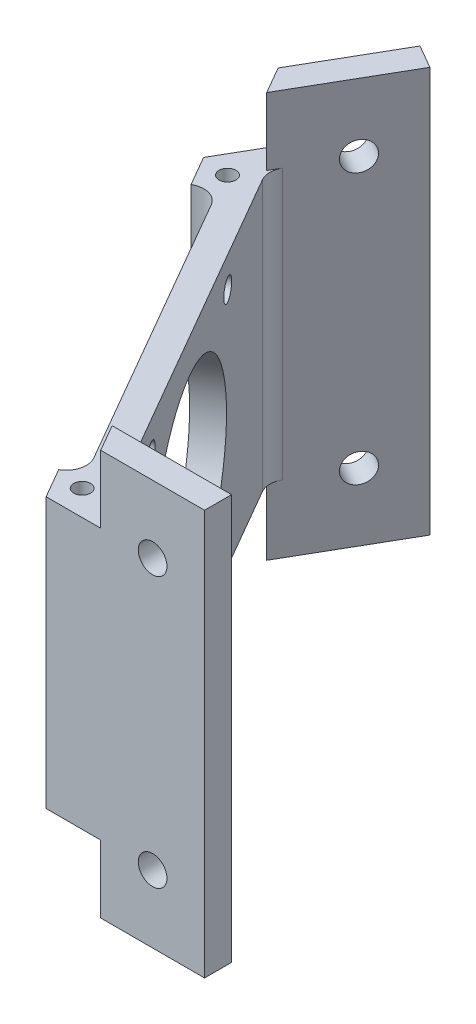
ISO-10303-21;
HEADER;
FILE_DESCRIPTION(('STEP AP214'),'2;1');
FILE_NAME('part.step','',(''),(''),'','','');
FILE_SCHEMA(('AUTOMOTIVE_DESIGN { 1 0 10303 214 1 1 1 1 }'));
ENDSEC;
DATA;
#1=APPLICATION_CONTEXT('core data for automotive mechanical design processes');
#2=APPLICATION_PROTOCOL_DEFINITION('international standard','automotive_design',2000,#1);
#3=PRODUCT_CONTEXT('',#1,'mechanical');
#4=PRODUCT('Part','Part','',(#3));
#5=PRODUCT_RELATED_PRODUCT_CATEGORY('part','',(#4));
#6=PRODUCT_DEFINITION_FORMATION('','',#4);
#7=PRODUCT_DEFINITION_CONTEXT('part definition',#1,'design');
#8=PRODUCT_DEFINITION('design','',#6,#7);
#9=PRODUCT_DEFINITION_SHAPE('','',#8);
#10=(LENGTH_UNIT() NAMED_UNIT(*) SI_UNIT(.MILLI.,.METRE.));
#11=(NAMED_UNIT(*) PLANE_ANGLE_UNIT() SI_UNIT($,.RADIAN.));
#12=(NAMED_UNIT(*) SI_UNIT($,.STERADIAN.) SOLID_ANGLE_UNIT());
#13=UNCERTAINTY_MEASURE_WITH_UNIT(LENGTH_MEASURE(1.E-05),#10,'distance_accuracy_value','');
#14=(GEOMETRIC_REPRESENTATION_CONTEXT(3) GLOBAL_UNCERTAINTY_ASSIGNED_CONTEXT((#13)) GLOBAL_UNIT_ASSIGNED_CONTEXT((#10,
#11,#12)) REPRESENTATION_CONTEXT('',''));
#15=CARTESIAN_POINT('',(0.,0.,0.));
#16=DIRECTION('',(0.,0.,1.));
#17=DIRECTION('',(1.,0.,0.));
#18=AXIS2_PLACEMENT_3D('',#15,#16,#17);
#19=CARTESIAN_POINT('',(84.4999999999999,60.,-9.99999999999996));
#20=DIRECTION('',(0.,0.,-1.));
#21=DIRECTION('',(-1.,0.,0.));
#22=AXIS2_PLACEMENT_3D('',#19,#20,#21);
#23=PLANE('',#22);
#24=CARTESIAN_POINT('',(96.8094010767584,50.,-9.99999999999961));
#25=DIRECTION('',(0.,0.,1.));
#26=DIRECTION('',(1.,0.,0.));
#27=AXIS2_PLACEMENT_3D('',#24,#25,#26);
#28=CIRCLE('',#27,2.125);
#29=CARTESIAN_POINT('',(98.9344010767584,50.,-9.99999999999961));
#30=VERTEX_POINT('',#29);
#31=EDGE_CURVE('E397',#30,#30,#28,.T.);
#32=ORIENTED_EDGE('',*,*,#31,.F.);
#33=EDGE_LOOP('',(#32));
#34=FACE_BOUND('',#33,.T.);
#35=CARTESIAN_POINT('',(96.8094010767584,10.,-9.99999999999961));
#36=DIRECTION('',(0.,0.,1.));
#37=DIRECTION('',(1.,0.,0.));
#38=AXIS2_PLACEMENT_3D('',#35,#36,#37);
#39=CIRCLE('',#38,2.125);
#40=CARTESIAN_POINT('',(98.9344010767584,10.,-9.99999999999961));
#41=VERTEX_POINT('',#40);
#42=EDGE_CURVE('E392',#41,#41,#39,.T.);
#43=ORIENTED_EDGE('',*,*,#42,.F.);
#44=EDGE_LOOP('',(#43));
#45=FACE_BOUND('',#44,.T.);
#46=DIRECTION('',(1.,0.,0.));
#47=VECTOR('',#46,1.);
#48=CARTESIAN_POINT('',(89.118802153517,50.,-9.99999999999996));
#49=LINE('',#48,#47);
#50=CARTESIAN_POINT('',(81.0358,50.,-10.));
#51=VERTEX_POINT('',#50);
#52=CARTESIAN_POINT('',(89.118802153517,50.,-9.99999999999996));
#53=VERTEX_POINT('',#52);
#54=EDGE_CURVE('E192',#51,#53,#49,.T.);
#55=ORIENTED_EDGE('',*,*,#54,.F.);
#56=DIRECTION('',(0.,1.,0.));
#57=VECTOR('',#56,1.);
#58=CARTESIAN_POINT('',(81.0358,-54.9007891464202,-10.));
#59=LINE('',#58,#57);
#60=CARTESIAN_POINT('',(81.0358,10.,-10.));
#61=VERTEX_POINT('',#60);
#62=EDGE_CURVE('E178',#61,#51,#59,.T.);
#63=ORIENTED_EDGE('',*,*,#62,.F.);
#64=DIRECTION('',(1.,0.,0.));
#65=VECTOR('',#64,1.);
#66=CARTESIAN_POINT('',(89.118802153517,10.,-9.99999999999996));
#67=LINE('',#66,#65);
#68=CARTESIAN_POINT('',(89.118802153517,10.,-9.99999999999996));
#69=VERTEX_POINT('',#68);
#70=EDGE_CURVE('E425',#61,#69,#67,.T.);
#71=ORIENTED_EDGE('',*,*,#70,.T.);
#72=DIRECTION('',(0.,-1.,0.));
#73=VECTOR('',#72,1.);
#74=CARTESIAN_POINT('',(89.118802153517,10.,-9.99999999999996));
#75=LINE('',#74,#73);
#76=CARTESIAN_POINT('',(89.118802153517,0.,-9.99999999999996));
#77=VERTEX_POINT('',#76);
#78=EDGE_CURVE('E325',#69,#77,#75,.T.);
#79=ORIENTED_EDGE('',*,*,#78,.T.);
#80=DIRECTION('',(1.,0.,0.));
#81=VECTOR('',#80,1.);
#82=CARTESIAN_POINT('',(84.4999999999999,0.,-9.99999999999996));
#83=LINE('',#82,#81);
#84=CARTESIAN_POINT('',(104.5,0.,-10.));
#85=VERTEX_POINT('',#84);
#86=EDGE_CURVE('E235',#77,#85,#83,.T.);
#87=ORIENTED_EDGE('',*,*,#86,.T.);
#88=DIRECTION('',(0.,-1.,0.));
#89=VECTOR('',#88,1.);
#90=CARTESIAN_POINT('',(104.5,60.,-10.));
#91=LINE('',#90,#89);
#92=CARTESIAN_POINT('',(104.5,60.,-10.));
#93=VERTEX_POINT('',#92);
#94=EDGE_CURVE('E283',#93,#85,#91,.T.);
#95=ORIENTED_EDGE('',*,*,#94,.F.);
#96=DIRECTION('',(1.,0.,0.));
#97=VECTOR('',#96,1.);
#98=CARTESIAN_POINT('',(76.4171,60.,-10.));
#99=LINE('',#98,#97);
#100=CARTESIAN_POINT('',(89.118802153517,60.,-9.99999999999996));
#101=VERTEX_POINT('',#100);
#102=EDGE_CURVE('E239',#101,#93,#99,.T.);
#103=ORIENTED_EDGE('',*,*,#102,.F.);
#104=DIRECTION('',(0.,1.,0.));
#105=VECTOR('',#104,1.);
#106=CARTESIAN_POINT('',(89.118802153517,50.,-9.99999999999996));
#107=LINE('',#106,#105);
#108=EDGE_CURVE('E200',#53,#101,#107,.T.);
#109=ORIENTED_EDGE('',*,*,#108,.F.);
#110=EDGE_LOOP('',(#55,#63,#71,#79,#87,#95,#103,#109));
#111=FACE_BOUND('',#110,.T.);
#112=ADVANCED_FACE('F32',(#34,#45,#111),#23,.F.);
#113=CARTESIAN_POINT('',(60.9102540378444,60.,-85.4996546954738));
#114=DIRECTION('',(0.866025403784438,0.,0.500000000000001));
#115=DIRECTION('',(0.500000000000001,0.,-0.866025403784438));
#116=AXIS2_PLACEMENT_3D('',#113,#114,#115);
#117=PLANE('',#116);
#118=CARTESIAN_POINT('',(57.0649545762236,50.,-78.8394006576293));
#119=DIRECTION('',(-0.866025403784438,0.,-0.500000000000001));
#120=DIRECTION('',(-0.500000000000001,0.,0.866025403784438));
#121=AXIS2_PLACEMENT_3D('',#118,#119,#120);
#122=CIRCLE('',#121,2.12500000000001);
#123=CARTESIAN_POINT('',(56.0024545762236,50.,-76.9990966745874));
#124=VERTEX_POINT('',#123);
#125=EDGE_CURVE('E385',#124,#124,#122,.T.);
#126=ORIENTED_EDGE('',*,*,#125,.F.);
#127=EDGE_LOOP('',(#126));
#128=FACE_BOUND('',#127,.T.);
#129=CARTESIAN_POINT('',(57.0649545762236,10.,-78.8394006576293));
#130=DIRECTION('',(-0.866025403784438,0.,-0.500000000000001));
#131=DIRECTION('',(-0.500000000000001,0.,0.866025403784438));
#132=AXIS2_PLACEMENT_3D('',#129,#130,#131);
#133=CIRCLE('',#132,2.125);
#134=CARTESIAN_POINT('',(56.0024545762236,10.,-76.9990966745874));
#135=VERTEX_POINT('',#134);
#136=EDGE_CURVE('E384',#135,#135,#133,.T.);
#137=ORIENTED_EDGE('',*,*,#136,.F.);
#138=EDGE_LOOP('',(#137));
#139=FACE_BOUND('',#138,.T.);
#140=DIRECTION('',(-0.500000000000001,0.,0.866025403784438));
#141=VECTOR('',#140,1.);
#142=CARTESIAN_POINT('',(46.8688040378444,10.,-61.1791498835358));
#143=LINE('',#142,#141);
#144=CARTESIAN_POINT('',(53.2196551146029,10.,-72.179146619785));
#145=VERTEX_POINT('',#144);
#146=CARTESIAN_POINT('',(49.1781540378444,10.,-65.1790614159949));
#147=VERTEX_POINT('',#146);
#148=EDGE_CURVE('E348',#145,#147,#143,.T.);
#149=ORIENTED_EDGE('',*,*,#148,.T.);
#150=DIRECTION('',(0.,1.,0.));
#151=VECTOR('',#150,1.);
#152=CARTESIAN_POINT('',(49.1781540378444,-54.9007891464202,-65.1790614159949));
#153=LINE('',#152,#151);
#154=CARTESIAN_POINT('',(49.1781540378444,50.,-65.1790614159949));
#155=VERTEX_POINT('',#154);
#156=EDGE_CURVE('E185',#147,#155,#153,.T.);
#157=ORIENTED_EDGE('',*,*,#156,.T.);
#158=DIRECTION('',(-0.500000000000001,0.,0.866025403784438));
#159=VECTOR('',#158,1.);
#160=CARTESIAN_POINT('',(46.8688040378444,50.,-61.1791498835358));
#161=LINE('',#160,#159);
#162=CARTESIAN_POINT('',(53.2196551146029,50.,-72.179146619785));
#163=VERTEX_POINT('',#162);
#164=EDGE_CURVE('E202',#163,#155,#161,.T.);
#165=ORIENTED_EDGE('',*,*,#164,.F.);
#166=DIRECTION('',(0.,1.,0.));
#167=VECTOR('',#166,1.);
#168=CARTESIAN_POINT('',(53.2196551146029,50.,-72.179146619785));
#169=LINE('',#168,#167);
#170=CARTESIAN_POINT('',(53.2196551146029,60.,-72.179146619785));
#171=VERTEX_POINT('',#170);
#172=EDGE_CURVE('E228',#163,#171,#169,.T.);
#173=ORIENTED_EDGE('',*,*,#172,.T.);
#174=DIRECTION('',(-0.5,0.,0.866025403784438));
#175=VECTOR('',#174,1.);
#176=CARTESIAN_POINT('',(50.9102540378444,60.,-68.179146619785));
#177=LINE('',#176,#175);
#178=CARTESIAN_POINT('',(60.9102540378444,60.,-85.4996546954738));
#179=VERTEX_POINT('',#178);
#180=EDGE_CURVE('E236',#179,#171,#177,.T.);
#181=ORIENTED_EDGE('',*,*,#180,.F.);
#182=DIRECTION('',(0.,-1.,0.));
#183=VECTOR('',#182,1.);
#184=CARTESIAN_POINT('',(60.9102540378444,60.,-85.4996546954738));
#185=LINE('',#184,#183);
#186=CARTESIAN_POINT('',(60.9102540378444,0.,-85.4996546954738));
#187=VERTEX_POINT('',#186);
#188=EDGE_CURVE('E251',#179,#187,#185,.T.);
#189=ORIENTED_EDGE('',*,*,#188,.T.);
#190=DIRECTION('',(-0.500000000000001,0.,0.866025403784438));
#191=VECTOR('',#190,1.);
#192=CARTESIAN_POINT('',(60.9102540378444,0.,-85.4996546954738));
#193=LINE('',#192,#191);
#194=CARTESIAN_POINT('',(53.2196551146029,0.,-72.179146619785));
#195=VERTEX_POINT('',#194);
#196=EDGE_CURVE('E240',#187,#195,#193,.T.);
#197=ORIENTED_EDGE('',*,*,#196,.T.);
#198=DIRECTION('',(0.,-1.,0.));
#199=VECTOR('',#198,1.);
#200=CARTESIAN_POINT('',(53.2196551146029,10.,-72.179146619785));
#201=LINE('',#200,#199);
#202=EDGE_CURVE('E323',#145,#195,#201,.T.);
#203=ORIENTED_EDGE('',*,*,#202,.F.);
#204=EDGE_LOOP('',(#149,#157,#165,#173,#181,#189,#197,#203));
#205=FACE_BOUND('',#204,.T.);
#206=ADVANCED_FACE('F345',(#128,#139,#205),#117,.F.);
#207=CARTESIAN_POINT('',(88.5414518843273,0.,-17.));
#208=DIRECTION('',(0.,1.,0.));
#209=DIRECTION('',(0.,0.,1.));
#210=AXIS2_PLACEMENT_3D('',#207,#208,#209);
#211=PLANE('',#210);
#212=DIRECTION('',(0.500000000000002,0.,-0.866025403784438));
#213=VECTOR('',#212,1.);
#214=CARTESIAN_POINT('',(56.3950815951458,0.,-69.679146619785));
#215=LINE('',#214,#213);
#216=CARTESIAN_POINT('',(55.5290561913614,0.,-68.179146619785));
#217=VERTEX_POINT('',#216);
#218=CARTESIAN_POINT('',(64.3743556529822,0.,-83.4996546954737));
#219=VERTEX_POINT('',#218);
#220=EDGE_CURVE('E257',#217,#219,#215,.T.);
#221=ORIENTED_EDGE('',*,*,#220,.F.);
#222=DIRECTION('',(-0.5,0.,-0.866025403784438));
#223=VECTOR('',#222,1.);
#224=CARTESIAN_POINT('',(55.5290561913614,0.,-68.179146619785));
#225=LINE('',#224,#223);
#226=EDGE_CURVE('E308',#217,#195,#225,.T.);
#227=ORIENTED_EDGE('',*,*,#226,.T.);
#228=ORIENTED_EDGE('',*,*,#196,.F.);
#229=DIRECTION('',(-0.866025403784437,0.,-0.500000000000003));
#230=VECTOR('',#229,1.);
#231=CARTESIAN_POINT('',(64.3743556529822,0.,-83.4996546954737));
#232=LINE('',#231,#230);
#233=EDGE_CURVE('E259',#219,#187,#232,.T.);
#234=ORIENTED_EDGE('',*,*,#233,.F.);
#235=EDGE_LOOP('',(#221,#227,#228,#234));
#236=FACE_BOUND('',#235,.T.);
#237=ADVANCED_FACE('F440',(#236),#211,.F.);
#238=DIRECTION('',(-0.499999999999998,0.,-0.86602540378444));
#239=VECTOR('',#238,1.);
#240=CARTESIAN_POINT('',(86.8094010767584,0.,-14.));
#241=LINE('',#240,#239);
#242=CARTESIAN_POINT('',(86.8094010767584,0.,-14.));
#243=VERTEX_POINT('',#242);
#244=EDGE_CURVE('E304',#77,#243,#241,.T.);
#245=ORIENTED_EDGE('',*,*,#244,.T.);
#246=DIRECTION('',(-1.,0.,0.));
#247=VECTOR('',#246,1.);
#248=CARTESIAN_POINT('',(104.5,0.,-14.));
#249=LINE('',#248,#247);
#250=CARTESIAN_POINT('',(104.5,0.,-14.));
#251=VERTEX_POINT('',#250);
#252=EDGE_CURVE('E255',#251,#243,#249,.T.);
#253=ORIENTED_EDGE('',*,*,#252,.F.);
#254=DIRECTION('',(0.,0.,-1.));
#255=VECTOR('',#254,1.);
#256=CARTESIAN_POINT('',(104.5,0.,-10.));
#257=LINE('',#256,#255);
#258=EDGE_CURVE('E253',#85,#251,#257,.T.);
#259=ORIENTED_EDGE('',*,*,#258,.F.);
#260=ORIENTED_EDGE('',*,*,#86,.F.);
#261=EDGE_LOOP('',(#245,#253,#259,#260));
#262=FACE_BOUND('',#261,.T.);
#263=ADVANCED_FACE('F519',(#262),#211,.F.);
#264=CARTESIAN_POINT('',(88.5414518843273,60.,-17.));
#265=DIRECTION('',(0.,1.,0.));
#266=DIRECTION('',(0.,0.,1.));
#267=AXIS2_PLACEMENT_3D('',#264,#265,#266);
#268=PLANE('',#267);
#269=DIRECTION('',(-1.,0.,0.));
#270=VECTOR('',#269,1.);
#271=CARTESIAN_POINT('',(104.5,60.,-14.));
#272=LINE('',#271,#270);
#273=CARTESIAN_POINT('',(104.5,60.,-14.));
#274=VERTEX_POINT('',#273);
#275=CARTESIAN_POINT('',(86.8094010767584,60.,-14.));
#276=VERTEX_POINT('',#275);
#277=EDGE_CURVE('E244',#274,#276,#272,.T.);
#278=ORIENTED_EDGE('',*,*,#277,.T.);
#279=DIRECTION('',(-0.499999999999998,0.,-0.86602540378444));
#280=VECTOR('',#279,1.);
#281=CARTESIAN_POINT('',(86.8094010767584,60.,-14.));
#282=LINE('',#281,#280);
#283=EDGE_CURVE('E218',#101,#276,#282,.T.);
#284=ORIENTED_EDGE('',*,*,#283,.F.);
#285=ORIENTED_EDGE('',*,*,#102,.T.);
#286=DIRECTION('',(0.,0.,-1.));
#287=VECTOR('',#286,1.);
#288=CARTESIAN_POINT('',(104.5,60.,-10.));
#289=LINE('',#288,#287);
#290=EDGE_CURVE('E242',#93,#274,#289,.T.);
#291=ORIENTED_EDGE('',*,*,#290,.T.);
#292=EDGE_LOOP('',(#278,#284,#285,#291));
#293=FACE_BOUND('',#292,.T.);
#294=ADVANCED_FACE('F478',(#293),#268,.T.);
#295=CARTESIAN_POINT('',(53.2196551146029,60.,-64.179146619785));
#296=DIRECTION('',(0.866025403784439,0.,-0.5));
#297=DIRECTION('',(-0.5,0.,-0.866025403784439));
#298=AXIS2_PLACEMENT_3D('',#295,#296,#297);
#299=PLANE('',#298);
#300=CARTESIAN_POINT('',(75.4551270189222,14.5,-25.6661795512337));
#301=DIRECTION('',(0.866025403784439,0.,-0.5));
#302=DIRECTION('',(-0.5,0.,-0.866025403784439));
#303=AXIS2_PLACEMENT_3D('',#300,#301,#302);
#304=CIRCLE('',#303,1.6);
#305=CARTESIAN_POINT('',(74.6551270189222,14.5,-27.0518201972888));
#306=VERTEX_POINT('',#305);
#307=EDGE_CURVE('E372',#306,#306,#304,.F.);
#308=ORIENTED_EDGE('',*,*,#307,.F.);
#309=EDGE_LOOP('',(#308));
#310=FACE_BOUND('',#309,.T.);
#311=CARTESIAN_POINT('',(59.9551270189222,14.5,-52.5129670685513));
#312=DIRECTION('',(0.866025403784439,0.,-0.5));
#313=DIRECTION('',(-0.5,0.,-0.866025403784439));
#314=AXIS2_PLACEMENT_3D('',#311,#312,#313);
#315=CIRCLE('',#314,1.6);
#316=CARTESIAN_POINT('',(59.1551270189222,14.5,-53.8986077146064));
#317=VERTEX_POINT('',#316);
#318=EDGE_CURVE('E366',#317,#317,#315,.F.);
#319=ORIENTED_EDGE('',*,*,#318,.F.);
#320=EDGE_LOOP('',(#319));
#321=FACE_BOUND('',#320,.T.);
#322=CARTESIAN_POINT('',(59.9551270189222,45.5,-52.5129670685513));
#323=DIRECTION('',(0.866025403784439,0.,-0.5));
#324=DIRECTION('',(-0.5,0.,-0.866025403784439));
#325=AXIS2_PLACEMENT_3D('',#322,#323,#324);
#326=CIRCLE('',#325,1.6);
#327=CARTESIAN_POINT('',(59.1551270189222,45.5,-53.8986077146064));
#328=VERTEX_POINT('',#327);
#329=EDGE_CURVE('E359',#328,#328,#326,.F.);
#330=ORIENTED_EDGE('',*,*,#329,.F.);
#331=EDGE_LOOP('',(#330));
#332=FACE_BOUND('',#331,.T.);
#333=CARTESIAN_POINT('',(75.4551270189222,45.5,-25.6661795512337));
#334=DIRECTION('',(0.866025403784439,0.,-0.5));
#335=DIRECTION('',(-0.5,0.,-0.866025403784439));
#336=AXIS2_PLACEMENT_3D('',#333,#334,#335);
#337=CIRCLE('',#336,1.6);
#338=CARTESIAN_POINT('',(74.6551270189222,45.5,-27.0518201972888));
#339=VERTEX_POINT('',#338);
#340=EDGE_CURVE('E358',#339,#339,#337,.F.);
#341=ORIENTED_EDGE('',*,*,#340,.F.);
#342=EDGE_LOOP('',(#341));
#343=FACE_BOUND('',#342,.T.);
#344=CARTESIAN_POINT('',(67.7051270189221,30.,-39.0895733098925));
#345=DIRECTION('',(0.866025403784439,0.,-0.5));
#346=DIRECTION('',(-0.5,0.,-0.866025403784439));
#347=AXIS2_PLACEMENT_3D('',#344,#345,#346);
#348=CIRCLE('',#347,15.);
#349=CARTESIAN_POINT('',(60.2051270189222,30.,-52.0799543666591));
#350=VERTEX_POINT('',#349);
#351=EDGE_CURVE('E381',#350,#350,#348,.F.);
#352=ORIENTED_EDGE('',*,*,#351,.F.);
#353=EDGE_LOOP('',(#352));
#354=FACE_BOUND('',#353,.T.);
#355=DIRECTION('',(-0.5,0.,-0.866025403784439));
#356=VECTOR('',#355,1.);
#357=CARTESIAN_POINT('',(53.2196551146029,50.,-64.179146619785));
#358=LINE('',#357,#356);
#359=CARTESIAN_POINT('',(79.5925227118881,50.,-18.5));
#360=VERTEX_POINT('',#359);
#361=CARTESIAN_POINT('',(55.8177313259562,50.,-59.679146619785));
#362=VERTEX_POINT('',#361);
#363=EDGE_CURVE('E226',#360,#362,#358,.T.);
#364=ORIENTED_EDGE('',*,*,#363,.T.);
#365=DIRECTION('',(0.,-1.,0.));
#366=VECTOR('',#365,1.);
#367=CARTESIAN_POINT('',(55.8177313259562,10.,-59.679146619785));
#368=LINE('',#367,#366);
#369=CARTESIAN_POINT('',(55.8177313259562,10.,-59.679146619785));
#370=VERTEX_POINT('',#369);
#371=EDGE_CURVE('E288',#362,#370,#368,.T.);
#372=ORIENTED_EDGE('',*,*,#371,.T.);
#373=DIRECTION('',(0.5,0.,0.866025403784439));
#374=VECTOR('',#373,1.);
#375=CARTESIAN_POINT('',(53.2196551146029,10.,-64.179146619785));
#376=LINE('',#375,#374);
#377=CARTESIAN_POINT('',(79.5925227118881,10.,-18.5));
#378=VERTEX_POINT('',#377);
#379=EDGE_CURVE('E219',#370,#378,#376,.T.);
#380=ORIENTED_EDGE('',*,*,#379,.T.);
#381=DIRECTION('',(0.,-1.,0.));
#382=VECTOR('',#381,1.);
#383=CARTESIAN_POINT('',(79.5925227118881,50.,-18.5));
#384=LINE('',#383,#382);
#385=EDGE_CURVE('E286',#378,#360,#384,.F.);
#386=ORIENTED_EDGE('',*,*,#385,.T.);
#387=EDGE_LOOP('',(#364,#372,#380,#386));
#388=FACE_BOUND('',#387,.T.);
#389=ADVANCED_FACE('F476',(#310,#321,#332,#343,#354,#388),#299,.F.);
#390=CARTESIAN_POINT('',(104.5,60.,-10.));
#391=DIRECTION('',(-1.,0.,0.));
#392=DIRECTION('',(0.,0.,1.));
#393=AXIS2_PLACEMENT_3D('',#390,#391,#392);
#394=PLANE('',#393);
#395=ORIENTED_EDGE('',*,*,#258,.T.);
#396=DIRECTION('',(0.,-1.,0.));
#397=VECTOR('',#396,1.);
#398=CARTESIAN_POINT('',(104.5,60.,-14.));
#399=LINE('',#398,#397);
#400=EDGE_CURVE('E280',#274,#251,#399,.T.);
#401=ORIENTED_EDGE('',*,*,#400,.F.);
#402=ORIENTED_EDGE('',*,*,#290,.F.);
#403=ORIENTED_EDGE('',*,*,#94,.T.);
#404=EDGE_LOOP('',(#395,#401,#402,#403));
#405=FACE_BOUND('',#404,.T.);
#406=ADVANCED_FACE('F474',(#405),#394,.F.);
#407=CARTESIAN_POINT('',(104.5,60.,-14.));
#408=DIRECTION('',(0.,0.,1.));
#409=DIRECTION('',(1.,0.,0.));
#410=AXIS2_PLACEMENT_3D('',#407,#408,#409);
#411=PLANE('',#410);
#412=CARTESIAN_POINT('',(96.8094010767584,50.,-14.));
#413=DIRECTION('',(0.,0.,1.));
#414=DIRECTION('',(1.,0.,0.));
#415=AXIS2_PLACEMENT_3D('',#412,#413,#414);
#416=CIRCLE('',#415,2.125);
#417=CARTESIAN_POINT('',(98.9344010767584,50.,-14.));
#418=VERTEX_POINT('',#417);
#419=EDGE_CURVE('E400',#418,#418,#416,.F.);
#420=ORIENTED_EDGE('',*,*,#419,.F.);
#421=EDGE_LOOP('',(#420));
#422=FACE_BOUND('',#421,.T.);
#423=CARTESIAN_POINT('',(96.8094010767584,10.,-14.));
#424=DIRECTION('',(0.,0.,1.));
#425=DIRECTION('',(1.,0.,0.));
#426=AXIS2_PLACEMENT_3D('',#423,#424,#425);
#427=CIRCLE('',#426,2.125);
#428=CARTESIAN_POINT('',(98.9344010767584,10.,-14.));
#429=VERTEX_POINT('',#428);
#430=EDGE_CURVE('E401',#429,#429,#427,.F.);
#431=ORIENTED_EDGE('',*,*,#430,.F.);
#432=EDGE_LOOP('',(#431));
#433=FACE_BOUND('',#432,.T.);
#434=ORIENTED_EDGE('',*,*,#252,.T.);
#435=DIRECTION('',(0.,-1.,0.));
#436=VECTOR('',#435,1.);
#437=CARTESIAN_POINT('',(86.8094010767584,10.,-14.));
#438=LINE('',#437,#436);
#439=CARTESIAN_POINT('',(86.8094010767584,10.,-14.));
#440=VERTEX_POINT('',#439);
#441=EDGE_CURVE('E328',#440,#243,#438,.T.);
#442=ORIENTED_EDGE('',*,*,#441,.F.);
#443=DIRECTION('',(1.,0.,0.));
#444=VECTOR('',#443,1.);
#445=CARTESIAN_POINT('',(88.5414518843273,10.,-14.));
#446=LINE('',#445,#444);
#447=CARTESIAN_POINT('',(88.5414518843273,10.,-14.));
#448=VERTEX_POINT('',#447);
#449=EDGE_CURVE('E421',#440,#448,#446,.T.);
#450=ORIENTED_EDGE('',*,*,#449,.T.);
#451=DIRECTION('',(0.,-1.,0.));
#452=VECTOR('',#451,1.);
#453=CARTESIAN_POINT('',(88.5414518843273,60.,-14.));
#454=LINE('',#453,#452);
#455=CARTESIAN_POINT('',(88.5414518843273,50.,-14.));
#456=VERTEX_POINT('',#455);
#457=EDGE_CURVE('E277',#456,#448,#454,.T.);
#458=ORIENTED_EDGE('',*,*,#457,.F.);
#459=DIRECTION('',(1.,0.,0.));
#460=VECTOR('',#459,1.);
#461=CARTESIAN_POINT('',(88.5414518843273,50.,-14.));
#462=LINE('',#461,#460);
#463=CARTESIAN_POINT('',(86.8094010767584,50.,-14.));
#464=VERTEX_POINT('',#463);
#465=EDGE_CURVE('E204',#464,#456,#462,.T.);
#466=ORIENTED_EDGE('',*,*,#465,.F.);
#467=DIRECTION('',(0.,1.,0.));
#468=VECTOR('',#467,1.);
#469=CARTESIAN_POINT('',(86.8094010767584,50.,-14.));
#470=LINE('',#469,#468);
#471=EDGE_CURVE('E223',#464,#276,#470,.T.);
#472=ORIENTED_EDGE('',*,*,#471,.T.);
#473=ORIENTED_EDGE('',*,*,#277,.F.);
#474=ORIENTED_EDGE('',*,*,#400,.T.);
#475=EDGE_LOOP('',(#434,#442,#450,#458,#466,#472,#473,#474));
#476=FACE_BOUND('',#475,.T.);
#477=ADVANCED_FACE('F503',(#422,#433,#476),#411,.F.);
#478=CARTESIAN_POINT('',(88.5414518843273,60.,-17.));
#479=DIRECTION('',(0.,-1.,0.));
#480=DIRECTION('',(0.,0.,-1.));
#481=AXIS2_PLACEMENT_3D('',#478,#479,#480);
#482=CYLINDRICAL_SURFACE('',#481,3.);
#483=ORIENTED_EDGE('',*,*,#457,.T.);
#484=CARTESIAN_POINT('',(88.5414518843273,10.,-17.));
#485=DIRECTION('',(0.,-1.,0.));
#486=DIRECTION('',(0.,0.,1.));
#487=AXIS2_PLACEMENT_3D('',#484,#485,#486);
#488=CIRCLE('',#487,3.);
#489=CARTESIAN_POINT('',(85.943375672974,10.,-15.5));
#490=VERTEX_POINT('',#489);
#491=EDGE_CURVE('E418',#448,#490,#488,.T.);
#492=ORIENTED_EDGE('',*,*,#491,.T.);
#493=DIRECTION('',(0.,-1.,0.));
#494=VECTOR('',#493,1.);
#495=CARTESIAN_POINT('',(85.943375672974,60.,-15.5));
#496=LINE('',#495,#494);
#497=CARTESIAN_POINT('',(85.943375672974,50.,-15.5));
#498=VERTEX_POINT('',#497);
#499=EDGE_CURVE('E274',#498,#490,#496,.T.);
#500=ORIENTED_EDGE('',*,*,#499,.F.);
#501=CARTESIAN_POINT('',(88.5414518843273,50.,-17.));
#502=DIRECTION('',(0.,-1.,0.));
#503=DIRECTION('',(0.,0.,1.));
#504=AXIS2_PLACEMENT_3D('',#501,#502,#503);
#505=CIRCLE('',#504,3.);
#506=EDGE_CURVE('E211',#456,#498,#505,.T.);
#507=ORIENTED_EDGE('',*,*,#506,.F.);
#508=EDGE_LOOP('',(#483,#492,#500,#507));
#509=FACE_BOUND('',#508,.T.);
#510=ADVANCED_FACE('F509',(#509),#482,.F.);
#511=CARTESIAN_POINT('',(85.943375672974,60.,-15.5));
#512=DIRECTION('',(-0.866025403784439,0.,0.5));
#513=DIRECTION('',(0.5,0.,0.866025403784439));
#514=AXIS2_PLACEMENT_3D('',#511,#512,#513);
#515=PLANE('',#514);
#516=CARTESIAN_POINT('',(78.9192286340599,14.5,-27.6661795512337));
#517=DIRECTION('',(0.866025403784439,0.,-0.5));
#518=DIRECTION('',(-0.5,0.,-0.866025403784439));
#519=AXIS2_PLACEMENT_3D('',#516,#517,#518);
#520=CIRCLE('',#519,1.6);
#521=CARTESIAN_POINT('',(78.1192286340599,14.5,-29.0518201972888));
#522=VERTEX_POINT('',#521);
#523=EDGE_CURVE('E354',#522,#522,#520,.T.);
#524=ORIENTED_EDGE('',*,*,#523,.F.);
#525=EDGE_LOOP('',(#524));
#526=FACE_BOUND('',#525,.T.);
#527=CARTESIAN_POINT('',(63.4192286340599,14.5,-54.5129670685513));
#528=DIRECTION('',(0.866025403784439,0.,-0.5));
#529=DIRECTION('',(-0.5,0.,-0.866025403784439));
#530=AXIS2_PLACEMENT_3D('',#527,#528,#529);
#531=CIRCLE('',#530,1.6);
#532=CARTESIAN_POINT('',(62.6192286340599,14.5,-55.8986077146064));
#533=VERTEX_POINT('',#532);
#534=EDGE_CURVE('E369',#533,#533,#531,.T.);
#535=ORIENTED_EDGE('',*,*,#534,.F.);
#536=EDGE_LOOP('',(#535));
#537=FACE_BOUND('',#536,.T.);
#538=CARTESIAN_POINT('',(63.4192286340599,45.5,-54.5129670685513));
#539=DIRECTION('',(0.866025403784439,0.,-0.5));
#540=DIRECTION('',(-0.5,0.,-0.866025403784439));
#541=AXIS2_PLACEMENT_3D('',#538,#539,#540);
#542=CIRCLE('',#541,1.6);
#543=CARTESIAN_POINT('',(62.6192286340599,45.5,-55.8986077146064));
#544=VERTEX_POINT('',#543);
#545=EDGE_CURVE('E363',#544,#544,#542,.T.);
#546=ORIENTED_EDGE('',*,*,#545,.F.);
#547=EDGE_LOOP('',(#546));
#548=FACE_BOUND('',#547,.T.);
#549=CARTESIAN_POINT('',(78.9192286340599,45.5,-27.6661795512337));
#550=DIRECTION('',(0.866025403784439,0.,-0.5));
#551=DIRECTION('',(-0.5,0.,-0.866025403784439));
#552=AXIS2_PLACEMENT_3D('',#549,#550,#551);
#553=CIRCLE('',#552,1.6);
#554=CARTESIAN_POINT('',(78.1192286340599,45.5,-29.0518201972888));
#555=VERTEX_POINT('',#554);
#556=EDGE_CURVE('E355',#555,#555,#553,.T.);
#557=ORIENTED_EDGE('',*,*,#556,.F.);
#558=EDGE_LOOP('',(#557));
#559=FACE_BOUND('',#558,.T.);
#560=CARTESIAN_POINT('',(71.1692286340599,30.,-41.0895733098925));
#561=DIRECTION('',(0.866025403784439,0.,-0.5));
#562=DIRECTION('',(-0.5,0.,-0.866025403784439));
#563=AXIS2_PLACEMENT_3D('',#560,#561,#562);
#564=CIRCLE('',#563,15.);
#565=CARTESIAN_POINT('',(63.6692286340599,30.,-54.0799543666591));
#566=VERTEX_POINT('',#565);
#567=EDGE_CURVE('E362',#566,#566,#564,.T.);
#568=ORIENTED_EDGE('',*,*,#567,.F.);
#569=EDGE_LOOP('',(#568));
#570=FACE_BOUND('',#569,.T.);
#571=ORIENTED_EDGE('',*,*,#499,.T.);
#572=DIRECTION('',(-0.5,0.,-0.866025403784439));
#573=VECTOR('',#572,1.);
#574=CARTESIAN_POINT('',(56.3950815951458,10.,-66.679146619785));
#575=LINE('',#574,#573);
#576=CARTESIAN_POINT('',(56.3950815951458,10.,-66.679146619785));
#577=VERTEX_POINT('',#576);
#578=EDGE_CURVE('E415',#490,#577,#575,.T.);
#579=ORIENTED_EDGE('',*,*,#578,.T.);
#580=DIRECTION('',(0.,-1.,0.));
#581=VECTOR('',#580,1.);
#582=CARTESIAN_POINT('',(56.3950815951458,60.,-66.679146619785));
#583=LINE('',#582,#581);
#584=CARTESIAN_POINT('',(56.3950815951458,50.,-66.679146619785));
#585=VERTEX_POINT('',#584);
#586=EDGE_CURVE('E271',#585,#577,#583,.T.);
#587=ORIENTED_EDGE('',*,*,#586,.F.);
#588=DIRECTION('',(-0.5,0.,-0.866025403784439));
#589=VECTOR('',#588,1.);
#590=CARTESIAN_POINT('',(56.3950815951458,50.,-66.679146619785));
#591=LINE('',#590,#589);
#592=EDGE_CURVE('E213',#498,#585,#591,.T.);
#593=ORIENTED_EDGE('',*,*,#592,.F.);
#594=EDGE_LOOP('',(#571,#579,#587,#593));
#595=FACE_BOUND('',#594,.T.);
#596=ADVANCED_FACE('F535',(#526,#537,#548,#559,#570,#595),#515,.F.);
#597=CARTESIAN_POINT('',(58.9931578064991,60.,-68.179146619785));
#598=DIRECTION('',(0.,-1.,0.));
#599=DIRECTION('',(0.,0.,-1.));
#600=AXIS2_PLACEMENT_3D('',#597,#598,#599);
#601=CYLINDRICAL_SURFACE('',#600,3.);
#602=ORIENTED_EDGE('',*,*,#586,.T.);
#603=CARTESIAN_POINT('',(58.9931578064992,10.,-68.179146619785));
#604=DIRECTION('',(0.,-1.,0.));
#605=DIRECTION('',(0.,0.,-1.));
#606=AXIS2_PLACEMENT_3D('',#603,#604,#605);
#607=CIRCLE('',#606,3.00000000000007);
#608=CARTESIAN_POINT('',(56.3950815951458,10.,-69.679146619785));
#609=VERTEX_POINT('',#608);
#610=EDGE_CURVE('E314',#577,#609,#607,.T.);
#611=ORIENTED_EDGE('',*,*,#610,.T.);
#612=DIRECTION('',(0.,-1.,0.));
#613=VECTOR('',#612,1.);
#614=CARTESIAN_POINT('',(56.3950815951458,60.,-69.679146619785));
#615=LINE('',#614,#613);
#616=CARTESIAN_POINT('',(56.3950815951458,50.,-69.679146619785));
#617=VERTEX_POINT('',#616);
#618=EDGE_CURVE('E268',#617,#609,#615,.T.);
#619=ORIENTED_EDGE('',*,*,#618,.F.);
#620=CARTESIAN_POINT('',(58.9931578064992,50.,-68.179146619785));
#621=DIRECTION('',(0.,-1.,0.));
#622=DIRECTION('',(0.,0.,-1.));
#623=AXIS2_PLACEMENT_3D('',#620,#621,#622);
#624=CIRCLE('',#623,3.00000000000007);
#625=EDGE_CURVE('E222',#585,#617,#624,.T.);
#626=ORIENTED_EDGE('',*,*,#625,.F.);
#627=EDGE_LOOP('',(#602,#611,#619,#626));
#628=FACE_BOUND('',#627,.T.);
#629=ADVANCED_FACE('F531',(#628),#601,.F.);
#630=CARTESIAN_POINT('',(56.3950815951458,60.,-69.679146619785));
#631=DIRECTION('',(-0.866025403784438,0.,-0.500000000000002));
#632=DIRECTION('',(-0.500000000000002,0.,0.866025403784438));
#633=AXIS2_PLACEMENT_3D('',#630,#631,#632);
#634=PLANE('',#633);
#635=CARTESIAN_POINT('',(60.5290561913614,50.,-76.8394006576293));
#636=DIRECTION('',(-0.866025403784438,0.,-0.500000000000002));
#637=DIRECTION('',(-0.500000000000002,0.,0.866025403784438));
#638=AXIS2_PLACEMENT_3D('',#635,#636,#637);
#639=CIRCLE('',#638,2.12500000000001);
#640=CARTESIAN_POINT('',(59.4665561913614,50.,-74.9990966745874));
#641=VERTEX_POINT('',#640);
#642=EDGE_CURVE('E388',#641,#641,#639,.F.);
#643=ORIENTED_EDGE('',*,*,#642,.F.);
#644=EDGE_LOOP('',(#643));
#645=FACE_BOUND('',#644,.T.);
#646=CARTESIAN_POINT('',(60.5290561913614,10.,-76.8394006576293));
#647=DIRECTION('',(-0.866025403784438,0.,-0.500000000000002));
#648=DIRECTION('',(-0.500000000000002,0.,0.866025403784438));
#649=AXIS2_PLACEMENT_3D('',#646,#647,#648);
#650=CIRCLE('',#649,2.125);
#651=CARTESIAN_POINT('',(59.4665561913614,10.,-74.9990966745874));
#652=VERTEX_POINT('',#651);
#653=EDGE_CURVE('E389',#652,#652,#650,.F.);
#654=ORIENTED_EDGE('',*,*,#653,.F.);
#655=EDGE_LOOP('',(#654));
#656=FACE_BOUND('',#655,.T.);
#657=ORIENTED_EDGE('',*,*,#220,.T.);
#658=DIRECTION('',(0.,-1.,0.));
#659=VECTOR('',#658,1.);
#660=CARTESIAN_POINT('',(64.3743556529822,60.,-83.4996546954737));
#661=LINE('',#660,#659);
#662=CARTESIAN_POINT('',(64.3743556529822,60.,-83.4996546954737));
#663=VERTEX_POINT('',#662);
#664=EDGE_CURVE('E265',#663,#219,#661,.T.);
#665=ORIENTED_EDGE('',*,*,#664,.F.);
#666=DIRECTION('',(0.500000000000002,0.,-0.866025403784438));
#667=VECTOR('',#666,1.);
#668=CARTESIAN_POINT('',(56.3950815951458,60.,-69.679146619785));
#669=LINE('',#668,#667);
#670=CARTESIAN_POINT('',(55.5290561913614,60.,-68.179146619785));
#671=VERTEX_POINT('',#670);
#672=EDGE_CURVE('E246',#671,#663,#669,.T.);
#673=ORIENTED_EDGE('',*,*,#672,.F.);
#674=DIRECTION('',(0.,1.,0.));
#675=VECTOR('',#674,1.);
#676=CARTESIAN_POINT('',(55.5290561913614,50.,-68.179146619785));
#677=LINE('',#676,#675);
#678=CARTESIAN_POINT('',(55.5290561913614,50.,-68.179146619785));
#679=VERTEX_POINT('',#678);
#680=EDGE_CURVE('E215',#679,#671,#677,.T.);
#681=ORIENTED_EDGE('',*,*,#680,.F.);
#682=DIRECTION('',(-0.500000000000001,0.,0.866025403784438));
#683=VECTOR('',#682,1.);
#684=CARTESIAN_POINT('',(56.3950815951458,50.,-69.679146619785));
#685=LINE('',#684,#683);
#686=EDGE_CURVE('E335',#617,#679,#685,.T.);
#687=ORIENTED_EDGE('',*,*,#686,.F.);
#688=ORIENTED_EDGE('',*,*,#618,.T.);
#689=DIRECTION('',(-0.500000000000001,0.,0.866025403784438));
#690=VECTOR('',#689,1.);
#691=CARTESIAN_POINT('',(56.3950815951458,10.,-69.679146619785));
#692=LINE('',#691,#690);
#693=CARTESIAN_POINT('',(55.5290561913614,10.,-68.179146619785));
#694=VERTEX_POINT('',#693);
#695=EDGE_CURVE('E317',#609,#694,#692,.T.);
#696=ORIENTED_EDGE('',*,*,#695,.T.);
#697=DIRECTION('',(0.,-1.,0.));
#698=VECTOR('',#697,1.);
#699=CARTESIAN_POINT('',(55.5290561913614,10.,-68.179146619785));
#700=LINE('',#699,#698);
#701=EDGE_CURVE('E320',#694,#217,#700,.T.);
#702=ORIENTED_EDGE('',*,*,#701,.T.);
#703=EDGE_LOOP('',(#657,#665,#673,#681,#687,#688,#696,#702));
#704=FACE_BOUND('',#703,.T.);
#705=ADVANCED_FACE('F432',(#645,#656,#704),#634,.F.);
#706=CARTESIAN_POINT('',(64.3743556529822,60.,-83.4996546954737));
#707=DIRECTION('',(-0.500000000000003,0.,0.866025403784437));
#708=DIRECTION('',(0.866025403784437,0.,0.500000000000003));
#709=AXIS2_PLACEMENT_3D('',#706,#707,#708);
#710=PLANE('',#709);
#711=ORIENTED_EDGE('',*,*,#233,.T.);
#712=ORIENTED_EDGE('',*,*,#188,.F.);
#713=DIRECTION('',(-0.866025403784437,0.,-0.500000000000003));
#714=VECTOR('',#713,1.);
#715=CARTESIAN_POINT('',(64.3743556529822,60.,-83.4996546954737));
#716=LINE('',#715,#714);
#717=EDGE_CURVE('E248',#663,#179,#716,.T.);
#718=ORIENTED_EDGE('',*,*,#717,.F.);
#719=ORIENTED_EDGE('',*,*,#664,.T.);
#720=EDGE_LOOP('',(#711,#712,#718,#719));
#721=FACE_BOUND('',#720,.T.);
#722=ADVANCED_FACE('F445',(#721),#710,.F.);
#723=DIRECTION('',(-0.5,0.,-0.866025403784438));
#724=VECTOR('',#723,1.);
#725=CARTESIAN_POINT('',(55.5290561913614,60.,-68.179146619785));
#726=LINE('',#725,#724);
#727=EDGE_CURVE('E216',#671,#171,#726,.T.);
#728=ORIENTED_EDGE('',*,*,#727,.F.);
#729=ORIENTED_EDGE('',*,*,#672,.T.);
#730=ORIENTED_EDGE('',*,*,#717,.T.);
#731=ORIENTED_EDGE('',*,*,#180,.T.);
#732=EDGE_LOOP('',(#728,#729,#730,#731));
#733=FACE_BOUND('',#732,.T.);
#734=ADVANCED_FACE('F449',(#733),#268,.T.);
#735=CARTESIAN_POINT('',(58.9931578064992,50.,-68.179146619785));
#736=DIRECTION('',(0.,-1.,0.));
#737=DIRECTION('',(0.,0.,-1.));
#738=AXIS2_PLACEMENT_3D('',#735,#736,#737);
#739=PLANE('',#738);
#740=CARTESIAN_POINT('',(53.2197,50.,-64.6791));
#741=DIRECTION('',(0.,1.,0.));
#742=DIRECTION('',(0.,0.,1.));
#743=AXIS2_PLACEMENT_3D('',#740,#741,#742);
#744=CIRCLE('',#743,1.25);
#745=CARTESIAN_POINT('',(53.2197,50.,-63.4291));
#746=VERTEX_POINT('',#745);
#747=EDGE_CURVE('E302',#746,#746,#744,.T.);
#748=ORIENTED_EDGE('',*,*,#747,.F.);
#749=EDGE_LOOP('',(#748));
#750=FACE_BOUND('',#749,.T.);
#751=CARTESIAN_POINT('',(82.6236,50.,-13.75));
#752=DIRECTION('',(0.,1.,0.));
#753=DIRECTION('',(0.,0.,1.));
#754=AXIS2_PLACEMENT_3D('',#751,#752,#753);
#755=CIRCLE('',#754,1.25);
#756=CARTESIAN_POINT('',(82.6236,50.,-12.5));
#757=VERTEX_POINT('',#756);
#758=EDGE_CURVE('E404',#757,#757,#755,.T.);
#759=ORIENTED_EDGE('',*,*,#758,.F.);
#760=EDGE_LOOP('',(#759));
#761=FACE_BOUND('',#760,.T.);
#762=ORIENTED_EDGE('',*,*,#164,.T.);
#763=DIRECTION('',(-0.5,0.,-0.866025403784438));
#764=VECTOR('',#763,1.);
#765=CARTESIAN_POINT('',(81.0358,50.,-10.));
#766=LINE('',#765,#764);
#767=CARTESIAN_POINT('',(51.7195813265612,50.,-60.7771802281954));
#768=VERTEX_POINT('',#767);
#769=EDGE_CURVE('E196',#768,#155,#766,.T.);
#770=ORIENTED_EDGE('',*,*,#769,.F.);
#771=CARTESIAN_POINT('',(53.2196551146029,50.,-58.179146619785));
#772=DIRECTION('',(0.,-1.,0.));
#773=DIRECTION('',(0.,0.,-1.));
#774=AXIS2_PLACEMENT_3D('',#771,#772,#773);
#775=CIRCLE('',#774,3.);
#776=EDGE_CURVE('E294',#768,#362,#775,.T.);
#777=ORIENTED_EDGE('',*,*,#776,.T.);
#778=ORIENTED_EDGE('',*,*,#363,.F.);
#779=CARTESIAN_POINT('',(76.9944465005348,50.,-17.));
#780=DIRECTION('',(0.,-1.,0.));
#781=DIRECTION('',(0.,0.,-1.));
#782=AXIS2_PLACEMENT_3D('',#779,#780,#781);
#783=CIRCLE('',#782,3.);
#784=CARTESIAN_POINT('',(78.4943727112832,50.,-14.4018811877995));
#785=VERTEX_POINT('',#784);
#786=EDGE_CURVE('E40',#360,#785,#783,.T.);
#787=ORIENTED_EDGE('',*,*,#786,.T.);
#788=EDGE_CURVE('E55',#51,#785,#766,.T.);
#789=ORIENTED_EDGE('',*,*,#788,.F.);
#790=ORIENTED_EDGE('',*,*,#54,.T.);
#791=DIRECTION('',(-0.499999999999998,0.,-0.86602540378444));
#792=VECTOR('',#791,1.);
#793=CARTESIAN_POINT('',(86.8094010767584,50.,-14.));
#794=LINE('',#793,#792);
#795=EDGE_CURVE('E201',#53,#464,#794,.T.);
#796=ORIENTED_EDGE('',*,*,#795,.T.);
#797=ORIENTED_EDGE('',*,*,#465,.T.);
#798=ORIENTED_EDGE('',*,*,#506,.T.);
#799=ORIENTED_EDGE('',*,*,#592,.T.);
#800=ORIENTED_EDGE('',*,*,#625,.T.);
#801=ORIENTED_EDGE('',*,*,#686,.T.);
#802=DIRECTION('',(-0.5,0.,-0.866025403784438));
#803=VECTOR('',#802,1.);
#804=CARTESIAN_POINT('',(55.5290561913614,50.,-68.179146619785));
#805=LINE('',#804,#803);
#806=EDGE_CURVE('E206',#679,#163,#805,.T.);
#807=ORIENTED_EDGE('',*,*,#806,.T.);
#808=EDGE_LOOP('',(#762,#770,#777,#778,#787,#789,#790,#796,#797,#798,#799,#800,#801,#807));
#809=FACE_BOUND('',#808,.T.);
#810=ADVANCED_FACE('F190',(#750,#761,#809),#739,.F.);
#811=CARTESIAN_POINT('',(86.8094010767584,50.,-14.));
#812=DIRECTION('',(0.86602540378444,0.,-0.499999999999998));
#813=DIRECTION('',(-0.499999999999998,0.,-0.86602540378444));
#814=AXIS2_PLACEMENT_3D('',#811,#812,#813);
#815=PLANE('',#814);
#816=ORIENTED_EDGE('',*,*,#283,.T.);
#817=ORIENTED_EDGE('',*,*,#471,.F.);
#818=ORIENTED_EDGE('',*,*,#795,.F.);
#819=ORIENTED_EDGE('',*,*,#108,.T.);
#820=EDGE_LOOP('',(#816,#817,#818,#819));
#821=FACE_BOUND('',#820,.T.);
#822=ADVANCED_FACE('F452',(#821),#815,.F.);
#823=CARTESIAN_POINT('',(55.5290561913614,50.,-68.179146619785));
#824=DIRECTION('',(0.866025403784438,0.,-0.5));
#825=DIRECTION('',(-0.5,0.,-0.866025403784439));
#826=AXIS2_PLACEMENT_3D('',#823,#824,#825);
#827=PLANE('',#826);
#828=ORIENTED_EDGE('',*,*,#727,.T.);
#829=ORIENTED_EDGE('',*,*,#172,.F.);
#830=ORIENTED_EDGE('',*,*,#806,.F.);
#831=ORIENTED_EDGE('',*,*,#680,.T.);
#832=EDGE_LOOP('',(#828,#829,#830,#831));
#833=FACE_BOUND('',#832,.T.);
#834=ADVANCED_FACE('F450',(#833),#827,.F.);
#835=CARTESIAN_POINT('',(58.9931578064992,10.,-68.179146619785));
#836=DIRECTION('',(0.,1.,0.));
#837=DIRECTION('',(0.,0.,-1.));
#838=AXIS2_PLACEMENT_3D('',#835,#836,#837);
#839=PLANE('',#838);
#840=CARTESIAN_POINT('',(53.2197,10.,-64.6791));
#841=DIRECTION('',(0.,1.,0.));
#842=DIRECTION('',(0.,0.,1.));
#843=AXIS2_PLACEMENT_3D('',#840,#841,#842);
#844=CIRCLE('',#843,1.25);
#845=CARTESIAN_POINT('',(53.2197,10.,-63.4291));
#846=VERTEX_POINT('',#845);
#847=EDGE_CURVE('E301',#846,#846,#844,.T.);
#848=ORIENTED_EDGE('',*,*,#847,.T.);
#849=EDGE_LOOP('',(#848));
#850=FACE_BOUND('',#849,.T.);
#851=CARTESIAN_POINT('',(82.6236,10.,-13.75));
#852=DIRECTION('',(0.,1.,0.));
#853=DIRECTION('',(0.,0.,1.));
#854=AXIS2_PLACEMENT_3D('',#851,#852,#853);
#855=CIRCLE('',#854,1.25);
#856=CARTESIAN_POINT('',(82.6236,10.,-12.5));
#857=VERTEX_POINT('',#856);
#858=EDGE_CURVE('E299',#857,#857,#855,.T.);
#859=ORIENTED_EDGE('',*,*,#858,.T.);
#860=EDGE_LOOP('',(#859));
#861=FACE_BOUND('',#860,.T.);
#862=ORIENTED_EDGE('',*,*,#70,.F.);
#863=DIRECTION('',(0.500000000000001,0.,0.866025403784438));
#864=VECTOR('',#863,1.);
#865=CARTESIAN_POINT('',(81.0358,10.,-10.));
#866=LINE('',#865,#864);
#867=CARTESIAN_POINT('',(78.4943727112832,10.,-14.4018811877995));
#868=VERTEX_POINT('',#867);
#869=EDGE_CURVE('E181',#868,#61,#866,.T.);
#870=ORIENTED_EDGE('',*,*,#869,.F.);
#871=CARTESIAN_POINT('',(76.9944465005348,10.,-17.));
#872=DIRECTION('',(0.,1.,0.));
#873=DIRECTION('',(0.,0.,1.));
#874=AXIS2_PLACEMENT_3D('',#871,#872,#873);
#875=CIRCLE('',#874,3.);
#876=EDGE_CURVE('E296',#868,#378,#875,.T.);
#877=ORIENTED_EDGE('',*,*,#876,.T.);
#878=ORIENTED_EDGE('',*,*,#379,.F.);
#879=CARTESIAN_POINT('',(53.2196551146029,10.,-58.179146619785));
#880=DIRECTION('',(0.,1.,0.));
#881=DIRECTION('',(0.,0.,1.));
#882=AXIS2_PLACEMENT_3D('',#879,#880,#881);
#883=CIRCLE('',#882,3.);
#884=CARTESIAN_POINT('',(51.7195813265612,10.,-60.7771802281954));
#885=VERTEX_POINT('',#884);
#886=EDGE_CURVE('E291',#370,#885,#883,.T.);
#887=ORIENTED_EDGE('',*,*,#886,.T.);
#888=EDGE_CURVE('E47',#147,#885,#866,.T.);
#889=ORIENTED_EDGE('',*,*,#888,.F.);
#890=ORIENTED_EDGE('',*,*,#148,.F.);
#891=DIRECTION('',(-0.5,0.,-0.866025403784438));
#892=VECTOR('',#891,1.);
#893=CARTESIAN_POINT('',(55.5290561913614,10.,-68.179146619785));
#894=LINE('',#893,#892);
#895=EDGE_CURVE('E427',#694,#145,#894,.T.);
#896=ORIENTED_EDGE('',*,*,#895,.F.);
#897=ORIENTED_EDGE('',*,*,#695,.F.);
#898=ORIENTED_EDGE('',*,*,#610,.F.);
#899=ORIENTED_EDGE('',*,*,#578,.F.);
#900=ORIENTED_EDGE('',*,*,#491,.F.);
#901=ORIENTED_EDGE('',*,*,#449,.F.);
#902=DIRECTION('',(-0.499999999999998,0.,-0.86602540378444));
#903=VECTOR('',#902,1.);
#904=CARTESIAN_POINT('',(86.8094010767584,10.,-14.));
#905=LINE('',#904,#903);
#906=EDGE_CURVE('E423',#69,#440,#905,.T.);
#907=ORIENTED_EDGE('',*,*,#906,.F.);
#908=EDGE_LOOP('',(#862,#870,#877,#878,#887,#889,#890,#896,#897,#898,#899,#900,#901,#907));
#909=FACE_BOUND('',#908,.T.);
#910=ADVANCED_FACE('F437',(#850,#861,#909),#839,.F.);
#911=CARTESIAN_POINT('',(55.5290561913614,10.,-68.179146619785));
#912=DIRECTION('',(-0.866025403784438,0.,0.5));
#913=DIRECTION('',(0.5,0.,0.866025403784439));
#914=AXIS2_PLACEMENT_3D('',#911,#912,#913);
#915=PLANE('',#914);
#916=ORIENTED_EDGE('',*,*,#226,.F.);
#917=ORIENTED_EDGE('',*,*,#701,.F.);
#918=ORIENTED_EDGE('',*,*,#895,.T.);
#919=ORIENTED_EDGE('',*,*,#202,.T.);
#920=EDGE_LOOP('',(#916,#917,#918,#919));
#921=FACE_BOUND('',#920,.T.);
#922=ADVANCED_FACE('F436',(#921),#915,.T.);
#923=CARTESIAN_POINT('',(86.8094010767584,10.,-14.));
#924=DIRECTION('',(-0.86602540378444,0.,0.499999999999998));
#925=DIRECTION('',(0.499999999999998,0.,0.86602540378444));
#926=AXIS2_PLACEMENT_3D('',#923,#924,#925);
#927=PLANE('',#926);
#928=ORIENTED_EDGE('',*,*,#244,.F.);
#929=ORIENTED_EDGE('',*,*,#78,.F.);
#930=ORIENTED_EDGE('',*,*,#906,.T.);
#931=ORIENTED_EDGE('',*,*,#441,.T.);
#932=EDGE_LOOP('',(#928,#929,#930,#931));
#933=FACE_BOUND('',#932,.T.);
#934=ADVANCED_FACE('F482',(#933),#927,.T.);
#935=CARTESIAN_POINT('',(53.2196551146029,60.,-58.179146619785));
#936=DIRECTION('',(0.,1.,0.));
#937=DIRECTION('',(0.,0.,1.));
#938=AXIS2_PLACEMENT_3D('',#935,#936,#937);
#939=CYLINDRICAL_SURFACE('',#938,3.);
#940=ORIENTED_EDGE('',*,*,#776,.F.);
#941=DIRECTION('',(0.,1.,0.));
#942=VECTOR('',#941,1.);
#943=CARTESIAN_POINT('',(51.7195813265612,60.,-60.7771802281954));
#944=LINE('',#943,#942);
#945=EDGE_CURVE('E352',#768,#885,#944,.F.);
#946=ORIENTED_EDGE('',*,*,#945,.T.);
#947=ORIENTED_EDGE('',*,*,#886,.F.);
#948=ORIENTED_EDGE('',*,*,#371,.F.);
#949=EDGE_LOOP('',(#940,#946,#947,#948));
#950=FACE_BOUND('',#949,.T.);
#951=ADVANCED_FACE('F480',(#950),#939,.F.);
#952=CARTESIAN_POINT('',(76.9944465005348,60.,-17.));
#953=DIRECTION('',(0.,1.,0.));
#954=DIRECTION('',(0.,0.,1.));
#955=AXIS2_PLACEMENT_3D('',#952,#953,#954);
#956=CYLINDRICAL_SURFACE('',#955,3.);
#957=ORIENTED_EDGE('',*,*,#876,.F.);
#958=DIRECTION('',(0.,1.,0.));
#959=VECTOR('',#958,1.);
#960=CARTESIAN_POINT('',(78.4943727112832,60.,-14.4018811877995));
#961=LINE('',#960,#959);
#962=EDGE_CURVE('E11',#868,#785,#961,.T.);
#963=ORIENTED_EDGE('',*,*,#962,.T.);
#964=ORIENTED_EDGE('',*,*,#786,.F.);
#965=ORIENTED_EDGE('',*,*,#385,.F.);
#966=EDGE_LOOP('',(#957,#963,#964,#965));
#967=FACE_BOUND('',#966,.T.);
#968=ADVANCED_FACE('F34',(#967),#956,.F.);
#969=CARTESIAN_POINT('',(82.6236,0.,-13.75));
#970=DIRECTION('',(0.,1.,0.));
#971=DIRECTION('',(0.,0.,1.));
#972=AXIS2_PLACEMENT_3D('',#969,#970,#971);
#973=CYLINDRICAL_SURFACE('',#972,1.25);
#974=ORIENTED_EDGE('',*,*,#758,.T.);
#975=EDGE_LOOP('',(#974));
#976=FACE_BOUND('',#975,.T.);
#977=ORIENTED_EDGE('',*,*,#858,.F.);
#978=EDGE_LOOP('',(#977));
#979=FACE_BOUND('',#978,.T.);
#980=ADVANCED_FACE('F488',(#976,#979),#973,.F.);
#981=CARTESIAN_POINT('',(53.2197,0.,-64.6791));
#982=DIRECTION('',(0.,1.,0.));
#983=DIRECTION('',(0.,0.,1.));
#984=AXIS2_PLACEMENT_3D('',#981,#982,#983);
#985=CYLINDRICAL_SURFACE('',#984,1.25);
#986=ORIENTED_EDGE('',*,*,#747,.T.);
#987=EDGE_LOOP('',(#986));
#988=FACE_BOUND('',#987,.T.);
#989=ORIENTED_EDGE('',*,*,#847,.F.);
#990=EDGE_LOOP('',(#989));
#991=FACE_BOUND('',#990,.T.);
#992=ADVANCED_FACE('F554',(#988,#991),#985,.F.);
#993=CARTESIAN_POINT('',(96.8094010767584,10.,-20.0104076400857));
#994=DIRECTION('',(0.,0.,1.));
#995=DIRECTION('',(1.,0.,0.));
#996=AXIS2_PLACEMENT_3D('',#993,#994,#995);
#997=CYLINDRICAL_SURFACE('',#996,2.125);
#998=ORIENTED_EDGE('',*,*,#430,.T.);
#999=EDGE_LOOP('',(#998));
#1000=FACE_BOUND('',#999,.T.);
#1001=ORIENTED_EDGE('',*,*,#42,.T.);
#1002=EDGE_LOOP('',(#1001));
#1003=FACE_BOUND('',#1002,.T.);
#1004=ADVANCED_FACE('F550',(#1000,#1003),#997,.F.);
#1005=CARTESIAN_POINT('',(96.8094010767584,50.,-20.0104076400857));
#1006=DIRECTION('',(0.,0.,1.));
#1007=DIRECTION('',(1.,0.,0.));
#1008=AXIS2_PLACEMENT_3D('',#1005,#1006,#1007);
#1009=CYLINDRICAL_SURFACE('',#1008,2.125);
#1010=ORIENTED_EDGE('',*,*,#419,.T.);
#1011=EDGE_LOOP('',(#1010));
#1012=FACE_BOUND('',#1011,.T.);
#1013=ORIENTED_EDGE('',*,*,#31,.T.);
#1014=EDGE_LOOP('',(#1013));
#1015=FACE_BOUND('',#1014,.T.);
#1016=ADVANCED_FACE('F553',(#1012,#1015),#1009,.F.);
#1017=CARTESIAN_POINT('',(65.7342218947757,10.,-73.8341968375865));
#1018=DIRECTION('',(-0.866025403784438,0.,-0.500000000000001));
#1019=DIRECTION('',(-0.500000000000001,0.,0.866025403784438));
#1020=AXIS2_PLACEMENT_3D('',#1017,#1018,#1019);
#1021=CYLINDRICAL_SURFACE('',#1020,2.125);
#1022=ORIENTED_EDGE('',*,*,#653,.T.);
#1023=EDGE_LOOP('',(#1022));
#1024=FACE_BOUND('',#1023,.T.);
#1025=ORIENTED_EDGE('',*,*,#136,.T.);
#1026=EDGE_LOOP('',(#1025));
#1027=FACE_BOUND('',#1026,.T.);
#1028=ADVANCED_FACE('F561',(#1024,#1027),#1021,.F.);
#1029=CARTESIAN_POINT('',(65.7342218947757,50.,-73.8341968375865));
#1030=DIRECTION('',(-0.866025403784438,0.,-0.500000000000001));
#1031=DIRECTION('',(-0.500000000000001,0.,0.866025403784438));
#1032=AXIS2_PLACEMENT_3D('',#1029,#1030,#1031);
#1033=CYLINDRICAL_SURFACE('',#1032,2.12500000000001);
#1034=ORIENTED_EDGE('',*,*,#642,.T.);
#1035=EDGE_LOOP('',(#1034));
#1036=FACE_BOUND('',#1035,.T.);
#1037=ORIENTED_EDGE('',*,*,#125,.T.);
#1038=EDGE_LOOP('',(#1037));
#1039=FACE_BOUND('',#1038,.T.);
#1040=ADVANCED_FACE('F684',(#1036,#1039),#1033,.F.);
#1041=CARTESIAN_POINT('',(30.9627808771745,30.,-17.8763698742961));
#1042=DIRECTION('',(0.866025403784439,0.,-0.5));
#1043=DIRECTION('',(-0.5,0.,-0.866025403784439));
#1044=AXIS2_PLACEMENT_3D('',#1041,#1042,#1043);
#1045=CYLINDRICAL_SURFACE('',#1044,15.);
#1046=ORIENTED_EDGE('',*,*,#351,.T.);
#1047=EDGE_LOOP('',(#1046));
#1048=FACE_BOUND('',#1047,.T.);
#1049=ORIENTED_EDGE('',*,*,#567,.T.);
#1050=EDGE_LOOP('',(#1049));
#1051=FACE_BOUND('',#1050,.T.);
#1052=ADVANCED_FACE('F688',(#1048,#1051),#1045,.F.);
#1053=CARTESIAN_POINT('',(38.7127808771745,45.5,-4.45297611563728));
#1054=DIRECTION('',(0.866025403784439,0.,-0.5));
#1055=DIRECTION('',(-0.5,0.,-0.866025403784439));
#1056=AXIS2_PLACEMENT_3D('',#1053,#1054,#1055);
#1057=CYLINDRICAL_SURFACE('',#1056,1.6);
#1058=ORIENTED_EDGE('',*,*,#340,.T.);
#1059=EDGE_LOOP('',(#1058));
#1060=FACE_BOUND('',#1059,.T.);
#1061=ORIENTED_EDGE('',*,*,#556,.T.);
#1062=EDGE_LOOP('',(#1061));
#1063=FACE_BOUND('',#1062,.T.);
#1064=ADVANCED_FACE('F770',(#1060,#1063),#1057,.F.);
#1065=CARTESIAN_POINT('',(23.2127808771745,45.5,-31.2997636329549));
#1066=DIRECTION('',(0.866025403784439,0.,-0.5));
#1067=DIRECTION('',(-0.5,0.,-0.866025403784439));
#1068=AXIS2_PLACEMENT_3D('',#1065,#1066,#1067);
#1069=CYLINDRICAL_SURFACE('',#1068,1.6);
#1070=ORIENTED_EDGE('',*,*,#329,.T.);
#1071=EDGE_LOOP('',(#1070));
#1072=FACE_BOUND('',#1071,.T.);
#1073=ORIENTED_EDGE('',*,*,#545,.T.);
#1074=EDGE_LOOP('',(#1073));
#1075=FACE_BOUND('',#1074,.T.);
#1076=ADVANCED_FACE('F773',(#1072,#1075),#1069,.F.);
#1077=CARTESIAN_POINT('',(23.2127808771745,14.5,-31.2997636329549));
#1078=DIRECTION('',(0.866025403784439,0.,-0.5));
#1079=DIRECTION('',(-0.5,0.,-0.866025403784439));
#1080=AXIS2_PLACEMENT_3D('',#1077,#1078,#1079);
#1081=CYLINDRICAL_SURFACE('',#1080,1.6);
#1082=ORIENTED_EDGE('',*,*,#318,.T.);
#1083=EDGE_LOOP('',(#1082));
#1084=FACE_BOUND('',#1083,.T.);
#1085=ORIENTED_EDGE('',*,*,#534,.T.);
#1086=EDGE_LOOP('',(#1085));
#1087=FACE_BOUND('',#1086,.T.);
#1088=ADVANCED_FACE('F777',(#1084,#1087),#1081,.F.);
#1089=CARTESIAN_POINT('',(38.7127808771745,14.5,-4.45297611563728));
#1090=DIRECTION('',(0.866025403784439,0.,-0.5));
#1091=DIRECTION('',(-0.5,0.,-0.866025403784439));
#1092=AXIS2_PLACEMENT_3D('',#1089,#1090,#1091);
#1093=CYLINDRICAL_SURFACE('',#1092,1.6);
#1094=ORIENTED_EDGE('',*,*,#307,.T.);
#1095=EDGE_LOOP('',(#1094));
#1096=FACE_BOUND('',#1095,.T.);
#1097=ORIENTED_EDGE('',*,*,#523,.T.);
#1098=EDGE_LOOP('',(#1097));
#1099=FACE_BOUND('',#1098,.T.);
#1100=ADVANCED_FACE('F756',(#1096,#1099),#1093,.F.);
#1101=CARTESIAN_POINT('',(81.0358,-54.9007891464202,-10.));
#1102=DIRECTION('',(0.866025403784438,0.,-0.500000000000001));
#1103=DIRECTION('',(-0.500000000000001,0.,-0.866025403784438));
#1104=AXIS2_PLACEMENT_3D('',#1101,#1102,#1103);
#1105=PLANE('',#1104);
#1106=ORIENTED_EDGE('',*,*,#869,.T.);
#1107=ORIENTED_EDGE('',*,*,#62,.T.);
#1108=ORIENTED_EDGE('',*,*,#788,.T.);
#1109=ORIENTED_EDGE('',*,*,#962,.F.);
#1110=EDGE_LOOP('',(#1106,#1107,#1108,#1109));
#1111=FACE_BOUND('',#1110,.T.);
#1112=ADVANCED_FACE('F179',(#1111),#1105,.F.);
#1113=ORIENTED_EDGE('',*,*,#769,.T.);
#1114=ORIENTED_EDGE('',*,*,#156,.F.);
#1115=ORIENTED_EDGE('',*,*,#888,.T.);
#1116=ORIENTED_EDGE('',*,*,#945,.F.);
#1117=EDGE_LOOP('',(#1113,#1114,#1115,#1116));
#1118=FACE_BOUND('',#1117,.T.);
#1119=ADVANCED_FACE('F755',(#1118),#1105,.F.);
#1120=CLOSED_SHELL('',(#112,#206,#237,#263,#294,#389,#406,#477,#510,#596,#629,#705,#722,#734,
#810,#822,#834,#910,#922,#934,#951,#968,#980,#992,#1004,#1016,#1028,#1040,#1052,#1064,#1076,
#1088,#1100,#1112,#1119));
#1121=MANIFOLD_SOLID_BREP('B2',#1120);
#1122=ADVANCED_BREP_SHAPE_REPRESENTATION('',(#18,#1121),#14);
#1123=SHAPE_DEFINITION_REPRESENTATION(#9,#1122);
ENDSEC;
END-ISO-10303-21;
